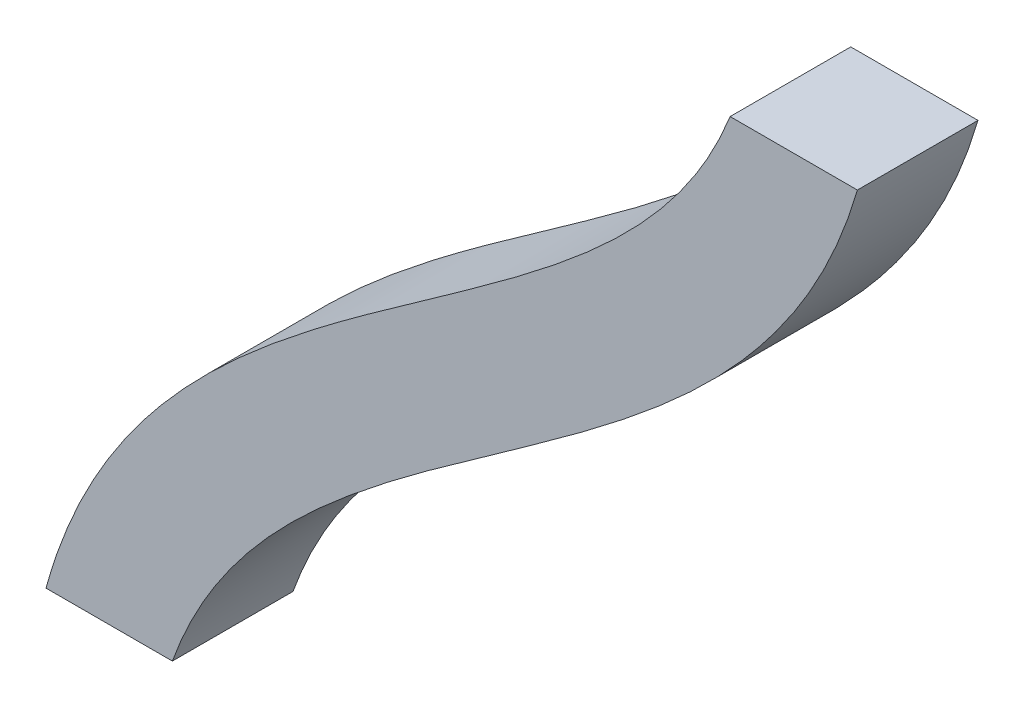
ISO-10303-21;
HEADER;
FILE_DESCRIPTION(('STEP AP214'),'2;1');
FILE_NAME('part.step','',(''),(''),'','','');
FILE_SCHEMA(('AUTOMOTIVE_DESIGN { 1 0 10303 214 1 1 1 1 }'));
ENDSEC;
DATA;
#1=APPLICATION_CONTEXT('core data for automotive mechanical design processes');
#2=APPLICATION_PROTOCOL_DEFINITION('international standard','automotive_design',2000,#1);
#3=PRODUCT_CONTEXT('',#1,'mechanical');
#4=PRODUCT('Part','Part','',(#3));
#5=PRODUCT_RELATED_PRODUCT_CATEGORY('part','',(#4));
#6=PRODUCT_DEFINITION_FORMATION('','',#4);
#7=PRODUCT_DEFINITION_CONTEXT('part definition',#1,'design');
#8=PRODUCT_DEFINITION('design','',#6,#7);
#9=PRODUCT_DEFINITION_SHAPE('','',#8);
#10=(LENGTH_UNIT() NAMED_UNIT(*) SI_UNIT(.MILLI.,.METRE.));
#11=(NAMED_UNIT(*) PLANE_ANGLE_UNIT() SI_UNIT($,.RADIAN.));
#12=(NAMED_UNIT(*) SI_UNIT($,.STERADIAN.) SOLID_ANGLE_UNIT());
#13=UNCERTAINTY_MEASURE_WITH_UNIT(LENGTH_MEASURE(1.E-05),#10,'distance_accuracy_value','');
#14=(GEOMETRIC_REPRESENTATION_CONTEXT(3) GLOBAL_UNCERTAINTY_ASSIGNED_CONTEXT((#13)) GLOBAL_UNIT_ASSIGNED_CONTEXT((#10,
#11,#12)) REPRESENTATION_CONTEXT('',''));
#15=CARTESIAN_POINT('',(0.,0.,0.));
#16=DIRECTION('',(0.,0.,1.));
#17=DIRECTION('',(1.,0.,0.));
#18=AXIS2_PLACEMENT_3D('',#15,#16,#17);
#19=CARTESIAN_POINT('',(226.598573256802,276.56702806941,35.));
#20=CARTESIAN_POINT('',(226.122488541724,261.288284190707,35.));
#21=CARTESIAN_POINT('',(224.451690954962,247.155649257519,35.));
#22=CARTESIAN_POINT('',(219.089653573612,220.717489302207,35.));
#23=CARTESIAN_POINT('',(215.399401115555,208.409190630284,35.));
#24=CARTESIAN_POINT('',(206.235433473245,185.126491829878,35.));
#25=CARTESIAN_POINT('',(200.758662752299,174.14878678493,35.));
#26=CARTESIAN_POINT('',(188.150641594815,153.125870735281,35.));
#27=CARTESIAN_POINT('',(181.016094815796,143.081433196304,35.));
#28=CARTESIAN_POINT('',(157.330590321036,113.952712828682,35.));
#29=CARTESIAN_POINT('',(138.463163826598,95.8747286108938,35.));
#30=CARTESIAN_POINT('',(96.4774897772449,60.9612465292984,35.));
#31=CARTESIAN_POINT('',(73.3856536402397,44.1464715253889,35.));
#32=CARTESIAN_POINT('',(25.4813401470222,10.1346181254785,35.));
#33=CARTESIAN_POINT('',(0.673613184258823,-7.0629269680179,35.));
#34=CARTESIAN_POINT('',(-48.0830615253516,-43.9492351560168,35.));
#35=CARTESIAN_POINT('',(-72.0478442655114,-63.645210456111,35.));
#36=CARTESIAN_POINT('',(-105.250543850072,-96.916333242389,35.));
#37=CARTESIAN_POINT('',(-115.856771286624,-108.630774221294,35.));
#38=CARTESIAN_POINT('',(-135.720134821198,-133.602080839609,35.));
#39=CARTESIAN_POINT('',(-144.97635127491,-146.860833280992,35.));
#40=CARTESIAN_POINT('',(-161.661047766344,-175.147036825431,35.));
#41=CARTESIAN_POINT('',(-169.086764702587,-190.174737104112,35.));
#42=CARTESIAN_POINT('',(-181.634547374702,-222.113027169231,35.));
#43=CARTESIAN_POINT('',(-186.754405107399,-239.020863027989,35.));
#44=CARTESIAN_POINT('',(-190.52902045006,-256.889221865088,35.));
#45=CARTESIAN_POINT('',(226.598573256802,276.56702806941,-35.));
#46=CARTESIAN_POINT('',(226.122488541724,261.288284190707,-35.));
#47=CARTESIAN_POINT('',(224.451690954962,247.155649257519,-35.));
#48=CARTESIAN_POINT('',(219.089653573612,220.717489302207,-35.));
#49=CARTESIAN_POINT('',(215.399401115555,208.409190630284,-35.));
#50=CARTESIAN_POINT('',(206.235433473245,185.126491829878,-35.));
#51=CARTESIAN_POINT('',(200.758662752299,174.14878678493,-35.));
#52=CARTESIAN_POINT('',(188.150641594815,153.125870735281,-35.));
#53=CARTESIAN_POINT('',(181.016094815796,143.081433196304,-35.));
#54=CARTESIAN_POINT('',(157.330590321036,113.952712828682,-35.));
#55=CARTESIAN_POINT('',(138.463163826598,95.8747286108938,-35.));
#56=CARTESIAN_POINT('',(96.4774897772449,60.9612465292984,-35.));
#57=CARTESIAN_POINT('',(73.3856536402397,44.1464715253889,-35.));
#58=CARTESIAN_POINT('',(25.4813401470222,10.1346181254785,-35.));
#59=CARTESIAN_POINT('',(0.673613184258823,-7.0629269680179,-35.));
#60=CARTESIAN_POINT('',(-48.0830615253516,-43.9492351560168,-35.));
#61=CARTESIAN_POINT('',(-72.0478442655114,-63.645210456111,-35.));
#62=CARTESIAN_POINT('',(-105.250543850072,-96.916333242389,-35.));
#63=CARTESIAN_POINT('',(-115.856771286624,-108.630774221294,-35.));
#64=CARTESIAN_POINT('',(-135.720134821198,-133.602080839609,-35.));
#65=CARTESIAN_POINT('',(-144.97635127491,-146.860833280992,-35.));
#66=CARTESIAN_POINT('',(-161.661047766344,-175.147036825431,-35.));
#67=CARTESIAN_POINT('',(-169.086764702587,-190.174737104112,-35.));
#68=CARTESIAN_POINT('',(-181.634547374702,-222.113027169231,-35.));
#69=CARTESIAN_POINT('',(-186.754405107399,-239.020863027989,-35.));
#70=CARTESIAN_POINT('',(-190.52902045006,-256.889221865088,-35.));
#71=B_SPLINE_SURFACE_WITH_KNOTS('',1,3,((#19,#20,#21,#22,#23,#24,#25,#26,#27,#28,#29,#30,#31,
#32,#33,#34,#35,#36,#37,#38,#39,#40,#41,#42,#43,#44),(#45,#46,#47,#48,#49,#50,#51,#52,#53,#54,
#55,#56,#57,#58,#59,#60,#61,#62,#63,#64,#65,#66,#67,#68,#69,#70)),.UNSPECIFIED.,.F.,.F.,.F.,(2,
2),(4,2,2,2,2,2,2,2,2,2,2,2,4),(0.,1.),(0.,0.0625,0.125,0.1875,0.25,0.375,0.5,0.625,0.75,0.8125,
0.875,0.9375,1.),.UNSPECIFIED.);
#72=DIRECTION('',(0.,0.,-1.));
#73=VECTOR('',#72,1.);
#74=CARTESIAN_POINT('',(-186.100430345033,-238.556260625531,0.));
#75=LINE('',#74,#73);
#76=CARTESIAN_POINT('',(-186.100430347691,-238.556260625531,35.));
#77=VERTEX_POINT('',#76);
#78=CARTESIAN_POINT('',(-186.100430347691,-238.556260625531,-35.));
#79=VERTEX_POINT('',#78);
#80=EDGE_CURVE('E74',#77,#79,#75,.T.);
#81=CARTESIAN_POINT('',(226.598573256802,276.56702806941,35.));
#82=CARTESIAN_POINT('',(226.122488541724,261.288284190707,35.));
#83=CARTESIAN_POINT('',(224.451690954962,247.155649257519,35.));
#84=CARTESIAN_POINT('',(219.089653573612,220.717489302207,35.));
#85=CARTESIAN_POINT('',(215.399401115555,208.409190630284,35.));
#86=CARTESIAN_POINT('',(206.235433473245,185.126491829878,35.));
#87=CARTESIAN_POINT('',(200.758662752299,174.14878678493,35.));
#88=CARTESIAN_POINT('',(188.150641594815,153.125870735281,35.));
#89=CARTESIAN_POINT('',(181.016094815796,143.081433196304,35.));
#90=CARTESIAN_POINT('',(157.330590321036,113.952712828682,35.));
#91=CARTESIAN_POINT('',(138.463163826598,95.8747286108938,35.));
#92=CARTESIAN_POINT('',(96.4774897772449,60.9612465292984,35.));
#93=CARTESIAN_POINT('',(73.3856536402397,44.1464715253889,35.));
#94=CARTESIAN_POINT('',(25.4813401470222,10.1346181254785,35.));
#95=CARTESIAN_POINT('',(0.673613184258823,-7.0629269680179,35.));
#96=CARTESIAN_POINT('',(-48.0830615253516,-43.9492351560168,35.));
#97=CARTESIAN_POINT('',(-72.0478442655114,-63.645210456111,35.));
#98=CARTESIAN_POINT('',(-105.250543850072,-96.916333242389,35.));
#99=CARTESIAN_POINT('',(-115.856771286624,-108.630774221294,35.));
#100=CARTESIAN_POINT('',(-135.720134821198,-133.602080839609,35.));
#101=CARTESIAN_POINT('',(-144.97635127491,-146.860833280992,35.));
#102=CARTESIAN_POINT('',(-161.661047766344,-175.147036825431,35.));
#103=CARTESIAN_POINT('',(-169.086764702587,-190.174737104112,35.));
#104=CARTESIAN_POINT('',(-181.634547374702,-222.113027169231,35.));
#105=CARTESIAN_POINT('',(-186.754405107399,-239.020863027989,35.));
#106=CARTESIAN_POINT('',(-190.52902045006,-256.889221865088,35.));
#107=B_SPLINE_CURVE_WITH_KNOTS('',3,(#81,#82,#83,#84,#85,#86,#87,#88,#89,#90,#91,#92,#93,#94,
#95,#96,#97,#98,#99,#100,#101,#102,#103,#104,#105,#106),.UNSPECIFIED.,.F.,.F.,(4,2,2,2,2,2,2,2,
2,2,2,2,4),(0.,0.0625,0.125,0.1875,0.25,0.375,0.5,0.625,0.75,0.8125,0.875,0.9375,1.),.UNSPECIFIED.);
#108=CARTESIAN_POINT('',(210.882928408578,196.934484186892,35.));
#109=VERTEX_POINT('',#108);
#110=EDGE_CURVE('E83',#109,#77,#107,.T.);
#111=DIRECTION('',(0.,0.,-1.));
#112=VECTOR('',#111,1.);
#113=CARTESIAN_POINT('',(210.882928406179,196.934484180784,0.));
#114=LINE('',#113,#112);
#115=CARTESIAN_POINT('',(210.882928408578,196.934484180784,-35.));
#116=VERTEX_POINT('',#115);
#117=EDGE_CURVE('E57',#116,#109,#114,.F.);
#118=CARTESIAN_POINT('',(226.598573256802,276.56702806941,-35.));
#119=CARTESIAN_POINT('',(226.122488541724,261.288284190707,-35.));
#120=CARTESIAN_POINT('',(224.451690954962,247.155649257519,-35.));
#121=CARTESIAN_POINT('',(219.089653573612,220.717489302207,-35.));
#122=CARTESIAN_POINT('',(215.399401115555,208.409190630284,-35.));
#123=CARTESIAN_POINT('',(206.235433473245,185.126491829878,-35.));
#124=CARTESIAN_POINT('',(200.758662752299,174.14878678493,-35.));
#125=CARTESIAN_POINT('',(188.150641594815,153.125870735281,-35.));
#126=CARTESIAN_POINT('',(181.016094815796,143.081433196304,-35.));
#127=CARTESIAN_POINT('',(157.330590321036,113.952712828682,-35.));
#128=CARTESIAN_POINT('',(138.463163826598,95.8747286108938,-35.));
#129=CARTESIAN_POINT('',(96.4774897772449,60.9612465292984,-35.));
#130=CARTESIAN_POINT('',(73.3856536402397,44.1464715253889,-35.));
#131=CARTESIAN_POINT('',(25.4813401470222,10.1346181254785,-35.));
#132=CARTESIAN_POINT('',(0.673613184258823,-7.0629269680179,-35.));
#133=CARTESIAN_POINT('',(-48.0830615253516,-43.9492351560168,-35.));
#134=CARTESIAN_POINT('',(-72.0478442655114,-63.645210456111,-35.));
#135=CARTESIAN_POINT('',(-105.250543850072,-96.916333242389,-35.));
#136=CARTESIAN_POINT('',(-115.856771286624,-108.630774221294,-35.));
#137=CARTESIAN_POINT('',(-135.720134821198,-133.602080839609,-35.));
#138=CARTESIAN_POINT('',(-144.97635127491,-146.860833280992,-35.));
#139=CARTESIAN_POINT('',(-161.661047766344,-175.147036825431,-35.));
#140=CARTESIAN_POINT('',(-169.086764702587,-190.174737104112,-35.));
#141=CARTESIAN_POINT('',(-181.634547374702,-222.113027169231,-35.));
#142=CARTESIAN_POINT('',(-186.754405107399,-239.020863027989,-35.));
#143=CARTESIAN_POINT('',(-190.52902045006,-256.889221865088,-35.));
#144=B_SPLINE_CURVE_WITH_KNOTS('',3,(#118,#119,#120,#121,#122,#123,#124,#125,#126,#127,#128,
#129,#130,#131,#132,#133,#134,#135,#136,#137,#138,#139,#140,#141,#142,#143),.UNSPECIFIED.,.F.,
.F.,(4,2,2,2,2,2,2,2,2,2,2,2,4),(0.,0.0625,0.125,0.1875,0.25,0.375,0.5,0.625,0.75,0.8125,0.875,
0.9375,1.),.UNSPECIFIED.);
#145=EDGE_CURVE('E85',#116,#79,#144,.T.);
#146=ORIENTED_EDGE('',*,*,#80,.F.);
#147=ORIENTED_EDGE('',*,*,#110,.F.);
#148=ORIENTED_EDGE('',*,*,#117,.F.);
#149=ORIENTED_EDGE('',*,*,#145,.T.);
#150=EDGE_LOOP('',(#146,#147,#148,#149));
#151=FACE_BOUND('',#150,.T.);
#152=ADVANCED_FACE('F35',(#151),#71,.T.);
#153=CARTESIAN_POINT('',(226.598573256802,276.56702806941,-35.));
#154=DIRECTION('',(0.,0.,1.));
#155=DIRECTION('',(1.,0.,0.));
#156=AXIS2_PLACEMENT_3D('',#153,#154,#155);
#157=PLANE('',#156);
#158=DIRECTION('',(-1.,0.,0.));
#159=VECTOR('',#158,1.);
#160=CARTESIAN_POINT('',(226.598573256802,-238.556260625531,-35.));
#161=LINE('',#160,#159);
#162=CARTESIAN_POINT('',(-112.769238564002,-238.556260625531,-35.));
#163=VERTEX_POINT('',#162);
#164=EDGE_CURVE('E87',#79,#163,#161,.F.);
#165=ORIENTED_EDGE('',*,*,#164,.F.);
#166=ORIENTED_EDGE('',*,*,#145,.F.);
#167=DIRECTION('',(1.,0.,0.));
#168=VECTOR('',#167,1.);
#169=CARTESIAN_POINT('',(226.598573256802,196.934484180784,-35.));
#170=LINE('',#169,#168);
#171=CARTESIAN_POINT('',(284.722086644628,196.934484180784,-35.));
#172=VERTEX_POINT('',#171);
#173=EDGE_CURVE('E92',#172,#116,#170,.F.);
#174=ORIENTED_EDGE('',*,*,#173,.F.);
#175=CARTESIAN_POINT('',(296.564615022146,274.386890530137,-35.));
#176=CARTESIAN_POINT('',(295.971282235017,255.345364054155,-35.));
#177=CARTESIAN_POINT('',(293.863748522708,237.229761393719,-35.));
#178=CARTESIAN_POINT('',(286.884130268871,202.815927488841,-35.));
#179=CARTESIAN_POINT('',(282.011058386408,186.520469888469,-35.));
#180=CARTESIAN_POINT('',(269.896218843215,155.740553251583,-35.));
#181=CARTESIAN_POINT('',(262.657506720705,141.259399134508,-35.));
#182=CARTESIAN_POINT('',(246.315238227292,114.009909757436,-35.));
#183=CARTESIAN_POINT('',(237.214978199041,101.240801032032,-35.));
#184=CARTESIAN_POINT('',(207.866328138223,65.1474756407297,-35.));
#185=CARTESIAN_POINT('',(185.604672749606,44.0355533957244,-35.));
#186=CARTESIAN_POINT('',(138.848901666269,5.1554636289168,-35.));
#187=CARTESIAN_POINT('',(114.328374550028,-12.6334267563763,-35.));
#188=CARTESIAN_POINT('',(65.5873565016472,-47.2393367377295,-35.));
#189=CARTESIAN_POINT('',(41.3621151654614,-64.0558896377385,-35.));
#190=CARTESIAN_POINT('',(-4.30507543486582,-98.6048837308403,-35.));
#191=CARTESIAN_POINT('',(-25.73118971272,-116.330112712117,-35.));
#192=CARTESIAN_POINT('',(-54.0862749528318,-144.743631325305,-35.));
#193=CARTESIAN_POINT('',(-62.9112156734701,-154.516209977271,-35.));
#194=CARTESIAN_POINT('',(-79.1011670150257,-174.869471818602,-35.));
#195=CARTESIAN_POINT('',(-86.4670972775395,-185.448268210815,-35.));
#196=CARTESIAN_POINT('',(-99.5848382396313,-207.68727574118,-35.));
#197=CARTESIAN_POINT('',(-105.339412039354,-219.347237708218,-35.));
#198=CARTESIAN_POINT('',(-115.077520316633,-244.133969753163,-35.));
#199=CARTESIAN_POINT('',(-119.063262797645,-257.263493762666,-35.));
#200=CARTESIAN_POINT('',(-122.040485139174,-271.357135708122,-35.));
#201=B_SPLINE_CURVE_WITH_KNOTS('',3,(#175,#176,#177,#178,#179,#180,#181,#182,#183,#184,#185,
#186,#187,#188,#189,#190,#191,#192,#193,#194,#195,#196,#197,#198,#199,#200),.UNSPECIFIED.,.F.,
.F.,(4,2,2,2,2,2,2,2,2,2,2,2,4),(0.,0.0625,0.125,0.1875,0.25,0.375,0.5,0.625,0.75,0.8125,0.875,
0.9375,1.),.UNSPECIFIED.);
#202=EDGE_CURVE('E90',#172,#163,#201,.T.);
#203=ORIENTED_EDGE('',*,*,#202,.T.);
#204=EDGE_LOOP('',(#165,#166,#174,#203));
#205=FACE_BOUND('',#204,.T.);
#206=ADVANCED_FACE('F126',(#205),#157,.F.);
#207=CARTESIAN_POINT('',(296.564615022146,274.386890530137,-35.));
#208=CARTESIAN_POINT('',(295.971282235017,255.345364054155,-35.));
#209=CARTESIAN_POINT('',(293.863748522708,237.229761393719,-35.));
#210=CARTESIAN_POINT('',(286.884130268871,202.815927488841,-35.));
#211=CARTESIAN_POINT('',(282.011058386408,186.520469888469,-35.));
#212=CARTESIAN_POINT('',(269.896218843215,155.740553251583,-35.));
#213=CARTESIAN_POINT('',(262.657506720705,141.259399134508,-35.));
#214=CARTESIAN_POINT('',(246.315238227292,114.009909757436,-35.));
#215=CARTESIAN_POINT('',(237.214978199041,101.240801032032,-35.));
#216=CARTESIAN_POINT('',(207.866328138223,65.1474756407297,-35.));
#217=CARTESIAN_POINT('',(185.604672749606,44.0355533957244,-35.));
#218=CARTESIAN_POINT('',(138.848901666269,5.1554636289168,-35.));
#219=CARTESIAN_POINT('',(114.328374550028,-12.6334267563763,-35.));
#220=CARTESIAN_POINT('',(65.5873565016472,-47.2393367377295,-35.));
#221=CARTESIAN_POINT('',(41.3621151654614,-64.0558896377385,-35.));
#222=CARTESIAN_POINT('',(-4.30507543486582,-98.6048837308403,-35.));
#223=CARTESIAN_POINT('',(-25.73118971272,-116.330112712117,-35.));
#224=CARTESIAN_POINT('',(-54.0862749528318,-144.743631325305,-35.));
#225=CARTESIAN_POINT('',(-62.9112156734701,-154.516209977271,-35.));
#226=CARTESIAN_POINT('',(-79.1011670150257,-174.869471818602,-35.));
#227=CARTESIAN_POINT('',(-86.4670972775395,-185.448268210815,-35.));
#228=CARTESIAN_POINT('',(-99.5848382396313,-207.68727574118,-35.));
#229=CARTESIAN_POINT('',(-105.339412039354,-219.347237708218,-35.));
#230=CARTESIAN_POINT('',(-115.077520316633,-244.133969753163,-35.));
#231=CARTESIAN_POINT('',(-119.063262797645,-257.263493762666,-35.));
#232=CARTESIAN_POINT('',(-122.040485139174,-271.357135708122,-35.));
#233=CARTESIAN_POINT('',(296.564615022146,274.386890530137,35.));
#234=CARTESIAN_POINT('',(295.971282235017,255.345364054155,35.));
#235=CARTESIAN_POINT('',(293.863748522708,237.229761393719,35.));
#236=CARTESIAN_POINT('',(286.884130268871,202.815927488841,35.));
#237=CARTESIAN_POINT('',(282.011058386408,186.520469888469,35.));
#238=CARTESIAN_POINT('',(269.896218843215,155.740553251583,35.));
#239=CARTESIAN_POINT('',(262.657506720705,141.259399134508,35.));
#240=CARTESIAN_POINT('',(246.315238227292,114.009909757436,35.));
#241=CARTESIAN_POINT('',(237.214978199041,101.240801032032,35.));
#242=CARTESIAN_POINT('',(207.866328138223,65.1474756407297,35.));
#243=CARTESIAN_POINT('',(185.604672749606,44.0355533957244,35.));
#244=CARTESIAN_POINT('',(138.848901666269,5.1554636289168,35.));
#245=CARTESIAN_POINT('',(114.328374550028,-12.6334267563763,35.));
#246=CARTESIAN_POINT('',(65.5873565016472,-47.2393367377295,35.));
#247=CARTESIAN_POINT('',(41.3621151654614,-64.0558896377385,35.));
#248=CARTESIAN_POINT('',(-4.30507543486582,-98.6048837308403,35.));
#249=CARTESIAN_POINT('',(-25.73118971272,-116.330112712117,35.));
#250=CARTESIAN_POINT('',(-54.0862749528318,-144.743631325305,35.));
#251=CARTESIAN_POINT('',(-62.9112156734701,-154.516209977271,35.));
#252=CARTESIAN_POINT('',(-79.1011670150257,-174.869471818602,35.));
#253=CARTESIAN_POINT('',(-86.4670972775395,-185.448268210815,35.));
#254=CARTESIAN_POINT('',(-99.5848382396313,-207.68727574118,35.));
#255=CARTESIAN_POINT('',(-105.339412039354,-219.347237708218,35.));
#256=CARTESIAN_POINT('',(-115.077520316633,-244.133969753163,35.));
#257=CARTESIAN_POINT('',(-119.063262797645,-257.263493762666,35.));
#258=CARTESIAN_POINT('',(-122.040485139174,-271.357135708122,35.));
#259=B_SPLINE_SURFACE_WITH_KNOTS('',1,3,((#207,#208,#209,#210,#211,#212,#213,#214,#215,#216,
#217,#218,#219,#220,#221,#222,#223,#224,#225,#226,#227,#228,#229,#230,#231,#232),(#233,#234,
#235,#236,#237,#238,#239,#240,#241,#242,#243,#244,#245,#246,#247,#248,#249,#250,#251,#252,#253,
#254,#255,#256,#257,#258)),.UNSPECIFIED.,.F.,.F.,.F.,(2,2),(4,2,2,2,2,2,2,2,2,2,2,2,4),(0.,1.),
(0.,0.0625,0.125,0.1875,0.25,0.375,0.5,0.625,0.75,0.8125,0.875,0.9375,1.),.UNSPECIFIED.);
#260=DIRECTION('',(0.,0.,1.));
#261=VECTOR('',#260,1.);
#262=CARTESIAN_POINT('',(-112.769238564002,-238.556260625531,0.));
#263=LINE('',#262,#261);
#264=CARTESIAN_POINT('',(-112.769238564001,-238.556260625529,35.));
#265=VERTEX_POINT('',#264);
#266=EDGE_CURVE('E49',#163,#265,#263,.T.);
#267=DIRECTION('',(0.,0.,1.));
#268=VECTOR('',#267,1.);
#269=CARTESIAN_POINT('',(284.722086644628,196.934484180784,0.));
#270=LINE('',#269,#268);
#271=CARTESIAN_POINT('',(284.722086644298,196.934484180784,35.));
#272=VERTEX_POINT('',#271);
#273=EDGE_CURVE('E86',#272,#172,#270,.F.);
#274=CARTESIAN_POINT('',(296.564615022146,274.386890530137,35.));
#275=CARTESIAN_POINT('',(295.971282235017,255.345364054155,35.));
#276=CARTESIAN_POINT('',(293.863748522708,237.229761393719,35.));
#277=CARTESIAN_POINT('',(286.884130268871,202.815927488841,35.));
#278=CARTESIAN_POINT('',(282.011058386408,186.520469888469,35.));
#279=CARTESIAN_POINT('',(269.896218843215,155.740553251583,35.));
#280=CARTESIAN_POINT('',(262.657506720705,141.259399134508,35.));
#281=CARTESIAN_POINT('',(246.315238227292,114.009909757436,35.));
#282=CARTESIAN_POINT('',(237.214978199041,101.240801032032,35.));
#283=CARTESIAN_POINT('',(207.866328138223,65.1474756407297,35.));
#284=CARTESIAN_POINT('',(185.604672749606,44.0355533957244,35.));
#285=CARTESIAN_POINT('',(138.848901666269,5.1554636289168,35.));
#286=CARTESIAN_POINT('',(114.328374550028,-12.6334267563763,35.));
#287=CARTESIAN_POINT('',(65.5873565016472,-47.2393367377295,35.));
#288=CARTESIAN_POINT('',(41.3621151654614,-64.0558896377385,35.));
#289=CARTESIAN_POINT('',(-4.30507543486582,-98.6048837308403,35.));
#290=CARTESIAN_POINT('',(-25.73118971272,-116.330112712117,35.));
#291=CARTESIAN_POINT('',(-54.0862749528318,-144.743631325305,35.));
#292=CARTESIAN_POINT('',(-62.9112156734701,-154.516209977271,35.));
#293=CARTESIAN_POINT('',(-79.1011670150257,-174.869471818602,35.));
#294=CARTESIAN_POINT('',(-86.4670972775395,-185.448268210815,35.));
#295=CARTESIAN_POINT('',(-99.5848382396313,-207.68727574118,35.));
#296=CARTESIAN_POINT('',(-105.339412039354,-219.347237708218,35.));
#297=CARTESIAN_POINT('',(-115.077520316633,-244.133969753163,35.));
#298=CARTESIAN_POINT('',(-119.063262797645,-257.263493762666,35.));
#299=CARTESIAN_POINT('',(-122.040485139174,-271.357135708122,35.));
#300=B_SPLINE_CURVE_WITH_KNOTS('',3,(#274,#275,#276,#277,#278,#279,#280,#281,#282,#283,#284,
#285,#286,#287,#288,#289,#290,#291,#292,#293,#294,#295,#296,#297,#298,#299),.UNSPECIFIED.,.F.,
.F.,(4,2,2,2,2,2,2,2,2,2,2,2,4),(0.,0.0625,0.125,0.1875,0.25,0.375,0.5,0.625,0.75,0.8125,0.875,
0.9375,1.),.UNSPECIFIED.);
#301=EDGE_CURVE('E106',#272,#265,#300,.T.);
#302=ORIENTED_EDGE('',*,*,#266,.F.);
#303=ORIENTED_EDGE('',*,*,#202,.F.);
#304=ORIENTED_EDGE('',*,*,#273,.F.);
#305=ORIENTED_EDGE('',*,*,#301,.T.);
#306=EDGE_LOOP('',(#302,#303,#304,#305));
#307=FACE_BOUND('',#306,.T.);
#308=ADVANCED_FACE('F120',(#307),#259,.T.);
#309=CARTESIAN_POINT('',(226.598573256802,276.56702806941,35.));
#310=DIRECTION('',(0.,0.,1.));
#311=DIRECTION('',(1.,0.,0.));
#312=AXIS2_PLACEMENT_3D('',#309,#310,#311);
#313=PLANE('',#312);
#314=DIRECTION('',(-1.,0.,0.));
#315=VECTOR('',#314,1.);
#316=CARTESIAN_POINT('',(226.598573256802,-238.556260625531,35.));
#317=LINE('',#316,#315);
#318=EDGE_CURVE('E11',#265,#77,#317,.T.);
#319=ORIENTED_EDGE('',*,*,#318,.F.);
#320=ORIENTED_EDGE('',*,*,#301,.F.);
#321=DIRECTION('',(1.,0.,0.));
#322=VECTOR('',#321,1.);
#323=CARTESIAN_POINT('',(226.598573256802,196.934484180784,35.));
#324=LINE('',#323,#322);
#325=EDGE_CURVE('E43',#109,#272,#324,.T.);
#326=ORIENTED_EDGE('',*,*,#325,.F.);
#327=ORIENTED_EDGE('',*,*,#110,.T.);
#328=EDGE_LOOP('',(#319,#320,#326,#327));
#329=FACE_BOUND('',#328,.T.);
#330=ADVANCED_FACE('F37',(#329),#313,.T.);
#331=CARTESIAN_POINT('',(196.354363500793,196.934484180784,-50.));
#332=DIRECTION('',(0.,-1.,0.));
#333=DIRECTION('',(0.,0.,-1.));
#334=AXIS2_PLACEMENT_3D('',#331,#332,#333);
#335=PLANE('',#334);
#336=ORIENTED_EDGE('',*,*,#117,.T.);
#337=ORIENTED_EDGE('',*,*,#325,.T.);
#338=ORIENTED_EDGE('',*,*,#273,.T.);
#339=ORIENTED_EDGE('',*,*,#173,.T.);
#340=EDGE_LOOP('',(#336,#337,#338,#339));
#341=FACE_BOUND('',#340,.T.);
#342=ADVANCED_FACE('F116',(#341),#335,.F.);
#343=CARTESIAN_POINT('',(-61.469451203628,-238.556260625531,-50.));
#344=DIRECTION('',(0.,1.,0.));
#345=DIRECTION('',(0.,0.,1.));
#346=AXIS2_PLACEMENT_3D('',#343,#344,#345);
#347=PLANE('',#346);
#348=ORIENTED_EDGE('',*,*,#80,.T.);
#349=ORIENTED_EDGE('',*,*,#164,.T.);
#350=ORIENTED_EDGE('',*,*,#266,.T.);
#351=ORIENTED_EDGE('',*,*,#318,.T.);
#352=EDGE_LOOP('',(#348,#349,#350,#351));
#353=FACE_BOUND('',#352,.T.);
#354=ADVANCED_FACE('F73',(#353),#347,.F.);
#355=CLOSED_SHELL('',(#152,#206,#308,#330,#342,#354));
#356=MANIFOLD_SOLID_BREP('B2',#355);
#357=ADVANCED_BREP_SHAPE_REPRESENTATION('',(#18,#356),#14);
#358=SHAPE_DEFINITION_REPRESENTATION(#9,#357);
ENDSEC;
END-ISO-10303-21;
